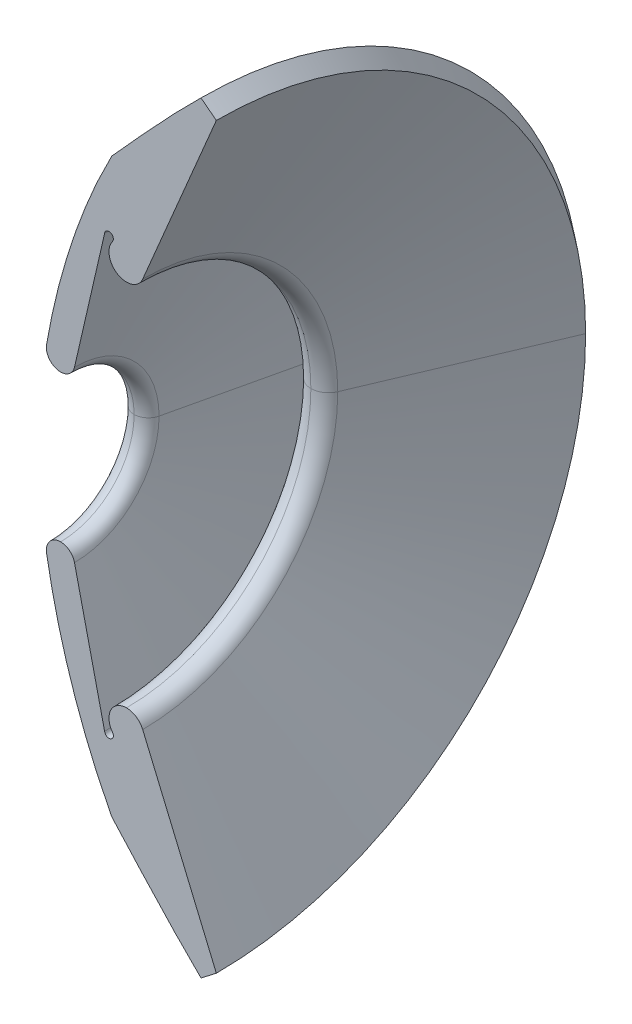
ISO-10303-21;
HEADER;
FILE_DESCRIPTION(('STEP AP214'),'2;1');
FILE_NAME('part.step','',(''),(''),'','','');
FILE_SCHEMA(('AUTOMOTIVE_DESIGN { 1 0 10303 214 1 1 1 1 }'));
ENDSEC;
DATA;
#1=APPLICATION_CONTEXT('core data for automotive mechanical design processes');
#2=APPLICATION_PROTOCOL_DEFINITION('international standard','automotive_design',2000,#1);
#3=PRODUCT_CONTEXT('',#1,'mechanical');
#4=PRODUCT('Part','Part','',(#3));
#5=PRODUCT_RELATED_PRODUCT_CATEGORY('part','',(#4));
#6=PRODUCT_DEFINITION_FORMATION('','',#4);
#7=PRODUCT_DEFINITION_CONTEXT('part definition',#1,'design');
#8=PRODUCT_DEFINITION('design','',#6,#7);
#9=PRODUCT_DEFINITION_SHAPE('','',#8);
#10=(LENGTH_UNIT() NAMED_UNIT(*) SI_UNIT(.MILLI.,.METRE.));
#11=(NAMED_UNIT(*) PLANE_ANGLE_UNIT() SI_UNIT($,.RADIAN.));
#12=(NAMED_UNIT(*) SI_UNIT($,.STERADIAN.) SOLID_ANGLE_UNIT());
#13=UNCERTAINTY_MEASURE_WITH_UNIT(LENGTH_MEASURE(1.E-05),#10,'distance_accuracy_value','');
#14=(GEOMETRIC_REPRESENTATION_CONTEXT(3) GLOBAL_UNCERTAINTY_ASSIGNED_CONTEXT((#13)) GLOBAL_UNIT_ASSIGNED_CONTEXT((#10,
#11,#12)) REPRESENTATION_CONTEXT('',''));
#15=CARTESIAN_POINT('',(0.,0.,0.));
#16=DIRECTION('',(0.,0.,1.));
#17=DIRECTION('',(1.,0.,0.));
#18=AXIS2_PLACEMENT_3D('',#15,#16,#17);
#19=CARTESIAN_POINT('',(0.,0.,0.));
#20=DIRECTION('',(0.,0.,1.));
#21=DIRECTION('',(1.,0.,0.));
#22=AXIS2_PLACEMENT_3D('',#19,#20,#21);
#23=PLANE('',#22);
#24=DIRECTION('',(-0.793279017623361,0.608858275954688,0.));
#25=VECTOR('',#24,1.);
#26=CARTESIAN_POINT('',(4.50781951059202,0.,0.));
#27=LINE('',#26,#25);
#28=CARTESIAN_POINT('',(-6.80370320936501,8.68183081701681,0.));
#29=VERTEX_POINT('',#28);
#30=CARTESIAN_POINT('',(-6.45373387807853,8.41322201866176,0.));
#31=VERTEX_POINT('',#30);
#32=EDGE_CURVE('E318',#29,#31,#27,.F.);
#33=ORIENTED_EDGE('',*,*,#32,.F.);
#34=CARTESIAN_POINT('',(-6.80370320936501,8.68183081701681,0.));
#35=CARTESIAN_POINT('',(-7.22405044240883,8.27392850217022,0.));
#36=CARTESIAN_POINT('',(-7.93930641714141,7.51090009317333,0.));
#37=CARTESIAN_POINT('',(-8.56158115236226,6.82596511589264,0.));
#38=CARTESIAN_POINT('',(-8.83528668489561,6.51959734050927,0.));
#39=(BOUNDED_CURVE() B_SPLINE_CURVE(3,(#34,#35,#36,#37,#38),.UNSPECIFIED.,.F.,
.F.) B_SPLINE_CURVE_WITH_KNOTS((4,1,4),(0.272608542358676,0.375,0.457699045748204),
.UNSPECIFIED.) CURVE() GEOMETRIC_REPRESENTATION_ITEM() RATIONAL_B_SPLINE_CURVE((1.,1.,1.,1.,1.)) REPRESENTATION_ITEM(''));
#40=CARTESIAN_POINT('',(-8.83528668489561,6.51959734050927,0.));
#41=VERTEX_POINT('',#40);
#42=EDGE_CURVE('E233',#29,#41,#39,.T.);
#43=ORIENTED_EDGE('',*,*,#42,.T.);
#44=DIRECTION('',(-0.439846475195651,-0.898072980474283,0.));
#45=VECTOR('',#44,1.);
#46=CARTESIAN_POINT('',(-12.0283700670541,0.,0.));
#47=LINE('',#46,#45);
#48=CARTESIAN_POINT('',(-9.17877169260346,5.81827398789354,0.));
#49=VERTEX_POINT('',#48);
#50=EDGE_CURVE('E323',#49,#41,#47,.F.);
#51=ORIENTED_EDGE('',*,*,#50,.F.);
#52=CARTESIAN_POINT('',(5.05300010291947,-0.560524208146894,0.));
#53=DIRECTION('',(0.,0.,1.));
#54=DIRECTION('',(1.,0.,0.));
#55=AXIS2_PLACEMENT_3D('',#52,#53,#54);
#56=CIRCLE('',#55,15.5959095555742);
#57=CARTESIAN_POINT('',(-10.3221203357982,2.05444545909126,0.));
#58=VERTEX_POINT('',#57);
#59=EDGE_CURVE('E61',#58,#49,#56,.F.);
#60=ORIENTED_EDGE('',*,*,#59,.F.);
#61=CARTESIAN_POINT('',(-10.00199980004,2.,0.));
#62=DIRECTION('',(0.,0.,1.));
#63=DIRECTION('',(1.,0.,0.));
#64=AXIS2_PLACEMENT_3D('',#61,#62,#63);
#65=CIRCLE('',#64,0.324717516358112);
#66=CARTESIAN_POINT('',(-10.00199980004,1.67528248364188,0.));
#67=VERTEX_POINT('',#66);
#68=EDGE_CURVE('E69',#67,#58,#65,.F.);
#69=ORIENTED_EDGE('',*,*,#68,.F.);
#70=CARTESIAN_POINT('',(-10.00199980004,2.,0.));
#71=DIRECTION('',(0.,0.,1.));
#72=DIRECTION('',(1.,0.,0.));
#73=AXIS2_PLACEMENT_3D('',#70,#71,#72);
#74=CIRCLE('',#73,0.324717516358112);
#75=CARTESIAN_POINT('',(-9.68553811514817,1.92724378084857,0.));
#76=VERTEX_POINT('',#75);
#77=EDGE_CURVE('E344',#76,#67,#74,.F.);
#78=ORIENTED_EDGE('',*,*,#77,.F.);
#79=DIRECTION('',(-0.224060038298619,-0.974575343027732,0.));
#80=VECTOR('',#79,1.);
#81=CARTESIAN_POINT('',(-10.1286216780938,0.,0.));
#82=LINE('',#81,#80);
#83=CARTESIAN_POINT('',(-8.99922025510829,4.91246358601071,0.));
#84=VERTEX_POINT('',#83);
#85=EDGE_CURVE('E349',#76,#84,#82,.F.);
#86=ORIENTED_EDGE('',*,*,#85,.T.);
#87=CARTESIAN_POINT('',(-8.9,4.9,0.));
#88=DIRECTION('',(0.,0.,1.));
#89=DIRECTION('',(1.,0.,0.));
#90=AXIS2_PLACEMENT_3D('',#87,#88,#89);
#91=CIRCLE('',#90,0.1);
#92=CARTESIAN_POINT('',(-8.82,4.84,0.));
#93=VERTEX_POINT('',#92);
#94=EDGE_CURVE('E346',#84,#93,#91,.F.);
#95=ORIENTED_EDGE('',*,*,#94,.T.);
#96=CARTESIAN_POINT('',(-8.5,4.6,0.));
#97=DIRECTION('',(0.,0.,1.));
#98=DIRECTION('',(1.,0.,0.));
#99=AXIS2_PLACEMENT_3D('',#96,#97,#98);
#100=CIRCLE('',#99,0.4);
#101=CARTESIAN_POINT('',(-8.5,4.2,0.));
#102=VERTEX_POINT('',#101);
#103=EDGE_CURVE('E339',#102,#93,#100,.F.);
#104=ORIENTED_EDGE('',*,*,#103,.F.);
#105=CARTESIAN_POINT('',(-8.5,4.6,0.));
#106=DIRECTION('',(0.,0.,1.));
#107=DIRECTION('',(1.,0.,0.));
#108=AXIS2_PLACEMENT_3D('',#105,#106,#107);
#109=CIRCLE('',#108,0.4);
#110=CARTESIAN_POINT('',(-8.13156827582901,4.44424999318014,0.));
#111=VERTEX_POINT('',#110);
#112=EDGE_CURVE('E337',#111,#102,#109,.F.);
#113=ORIENTED_EDGE('',*,*,#112,.F.);
#114=DIRECTION('',(-0.38937501704966,-0.921079310427488,0.));
#115=VECTOR('',#114,1.);
#116=CARTESIAN_POINT('',(-10.0103206235116,0.,0.));
#117=LINE('',#116,#115);
#118=EDGE_CURVE('E320',#111,#31,#117,.F.);
#119=ORIENTED_EDGE('',*,*,#118,.T.);
#120=EDGE_LOOP('',(#33,#43,#51,#60,#69,#78,#86,#95,#104,#113,#119));
#121=FACE_BOUND('',#120,.T.);
#122=ADVANCED_FACE('F46',(#121),#23,.T.);
#123=CARTESIAN_POINT('',(-10.00199980004,0.,0.));
#124=DIRECTION('',(1.,0.,0.));
#125=DIRECTION('',(0.,0.,-1.));
#126=AXIS2_PLACEMENT_3D('',#123,#124,#125);
#127=TOROIDAL_SURFACE('',#126,2.,0.324717516358112);
#128=CARTESIAN_POINT('',(-10.3221203357982,0.,0.));
#129=DIRECTION('',(1.,0.,0.));
#130=DIRECTION('',(0.,0.,-1.));
#131=AXIS2_PLACEMENT_3D('',#128,#129,#130);
#132=CIRCLE('',#131,2.05444545909116);
#133=CARTESIAN_POINT('',(-10.3221203357982,-2.05444545909126,0.));
#134=VERTEX_POINT('',#133);
#135=CARTESIAN_POINT('',(-10.3221203357982,0.,-2.05444545909116));
#136=VERTEX_POINT('',#135);
#137=EDGE_CURVE('E222',#134,#136,#132,.T.);
#138=ORIENTED_EDGE('',*,*,#137,.F.);
#139=CARTESIAN_POINT('',(-10.00199980004,-2.,0.));
#140=DIRECTION('',(0.,0.,1.));
#141=DIRECTION('',(1.,0.,0.));
#142=AXIS2_PLACEMENT_3D('',#139,#140,#141);
#143=CIRCLE('',#142,0.324717516358112);
#144=CARTESIAN_POINT('',(-10.00199980004,-1.67528248364189,0.));
#145=VERTEX_POINT('',#144);
#146=EDGE_CURVE('E368',#134,#145,#143,.F.);
#147=ORIENTED_EDGE('',*,*,#146,.T.);
#148=CARTESIAN_POINT('',(-10.00199980004,0.,0.));
#149=DIRECTION('',(1.,0.,0.));
#150=DIRECTION('',(0.,0.,-1.));
#151=AXIS2_PLACEMENT_3D('',#148,#149,#150);
#152=CIRCLE('',#151,1.67528248364188);
#153=CARTESIAN_POINT('',(-10.00199980004,0.,-1.67528248364188));
#154=VERTEX_POINT('',#153);
#155=EDGE_CURVE('E54',#145,#154,#152,.T.);
#156=ORIENTED_EDGE('',*,*,#155,.T.);
#157=CARTESIAN_POINT('',(-10.00199980004,0.,-2.));
#158=DIRECTION('',(0.,-1.,0.));
#159=DIRECTION('',(0.,0.,-1.));
#160=AXIS2_PLACEMENT_3D('',#157,#158,#159);
#161=CIRCLE('',#160,0.324717516358112);
#162=EDGE_CURVE('E244',#154,#136,#161,.T.);
#163=ORIENTED_EDGE('',*,*,#162,.T.);
#164=EDGE_LOOP('',(#138,#147,#156,#163));
#165=FACE_BOUND('',#164,.T.);
#166=ADVANCED_FACE('F375',(#165),#127,.T.);
#167=CARTESIAN_POINT('',(-8.5,0.,0.));
#168=DIRECTION('',(1.,0.,0.));
#169=DIRECTION('',(0.,0.,-1.));
#170=AXIS2_PLACEMENT_3D('',#167,#168,#169);
#171=TOROIDAL_SURFACE('',#170,4.6,0.4);
#172=CARTESIAN_POINT('',(-8.82,0.,0.));
#173=DIRECTION('',(1.,0.,0.));
#174=DIRECTION('',(0.,0.,-1.));
#175=AXIS2_PLACEMENT_3D('',#172,#173,#174);
#176=CIRCLE('',#175,4.84);
#177=CARTESIAN_POINT('',(-8.82,-4.84,0.));
#178=VERTEX_POINT('',#177);
#179=CARTESIAN_POINT('',(-8.82,0.,-4.84));
#180=VERTEX_POINT('',#179);
#181=EDGE_CURVE('E224',#178,#180,#176,.T.);
#182=ORIENTED_EDGE('',*,*,#181,.F.);
#183=CARTESIAN_POINT('',(-8.5,-4.6,0.));
#184=DIRECTION('',(0.,0.,1.));
#185=DIRECTION('',(1.,0.,0.));
#186=AXIS2_PLACEMENT_3D('',#183,#184,#185);
#187=CIRCLE('',#186,0.4);
#188=CARTESIAN_POINT('',(-8.5,-4.2,0.));
#189=VERTEX_POINT('',#188);
#190=EDGE_CURVE('E358',#178,#189,#187,.F.);
#191=ORIENTED_EDGE('',*,*,#190,.T.);
#192=CARTESIAN_POINT('',(-8.5,0.,0.));
#193=DIRECTION('',(1.,0.,0.));
#194=DIRECTION('',(0.,0.,-1.));
#195=AXIS2_PLACEMENT_3D('',#192,#193,#194);
#196=CIRCLE('',#195,4.2);
#197=CARTESIAN_POINT('',(-8.5,0.,-4.2));
#198=VERTEX_POINT('',#197);
#199=EDGE_CURVE('E208',#189,#198,#196,.T.);
#200=ORIENTED_EDGE('',*,*,#199,.T.);
#201=CARTESIAN_POINT('',(-8.5,0.,-4.6));
#202=DIRECTION('',(0.,-1.,0.));
#203=DIRECTION('',(0.,0.,-1.));
#204=AXIS2_PLACEMENT_3D('',#201,#202,#203);
#205=CIRCLE('',#204,0.4);
#206=EDGE_CURVE('E201',#198,#180,#205,.T.);
#207=ORIENTED_EDGE('',*,*,#206,.T.);
#208=EDGE_LOOP('',(#182,#191,#200,#207));
#209=FACE_BOUND('',#208,.T.);
#210=ADVANCED_FACE('F424',(#209),#171,.T.);
#211=CARTESIAN_POINT('',(-8.5,0.,0.));
#212=DIRECTION('',(1.,0.,0.));
#213=DIRECTION('',(0.,0.,-1.));
#214=AXIS2_PLACEMENT_3D('',#211,#212,#213);
#215=TOROIDAL_SURFACE('',#214,4.6,0.4);
#216=CARTESIAN_POINT('',(-8.5,0.,0.));
#217=DIRECTION('',(1.,0.,0.));
#218=DIRECTION('',(0.,0.,-1.));
#219=AXIS2_PLACEMENT_3D('',#216,#217,#218);
#220=CIRCLE('',#219,4.2);
#221=EDGE_CURVE('E239',#198,#102,#220,.T.);
#222=ORIENTED_EDGE('',*,*,#221,.T.);
#223=ORIENTED_EDGE('',*,*,#103,.T.);
#224=CARTESIAN_POINT('',(-8.82,0.,0.));
#225=DIRECTION('',(1.,0.,0.));
#226=DIRECTION('',(0.,0.,-1.));
#227=AXIS2_PLACEMENT_3D('',#224,#225,#226);
#228=CIRCLE('',#227,4.84);
#229=EDGE_CURVE('E303',#180,#93,#228,.T.);
#230=ORIENTED_EDGE('',*,*,#229,.F.);
#231=ORIENTED_EDGE('',*,*,#206,.F.);
#232=EDGE_LOOP('',(#222,#223,#230,#231));
#233=FACE_BOUND('',#232,.T.);
#234=ADVANCED_FACE('F407',(#233),#215,.T.);
#235=CARTESIAN_POINT('',(-10.00199980004,0.,0.));
#236=DIRECTION('',(1.,0.,0.));
#237=DIRECTION('',(0.,0.,-1.));
#238=AXIS2_PLACEMENT_3D('',#235,#236,#237);
#239=TOROIDAL_SURFACE('',#238,2.,0.324717516358112);
#240=CARTESIAN_POINT('',(-10.00199980004,0.,0.));
#241=DIRECTION('',(1.,0.,0.));
#242=DIRECTION('',(0.,0.,-1.));
#243=AXIS2_PLACEMENT_3D('',#240,#241,#242);
#244=CIRCLE('',#243,1.67528248364188);
#245=EDGE_CURVE('E236',#154,#67,#244,.T.);
#246=ORIENTED_EDGE('',*,*,#245,.T.);
#247=ORIENTED_EDGE('',*,*,#68,.T.);
#248=CARTESIAN_POINT('',(-10.3221203357982,0.,0.));
#249=DIRECTION('',(1.,0.,0.));
#250=DIRECTION('',(0.,0.,-1.));
#251=AXIS2_PLACEMENT_3D('',#248,#249,#250);
#252=CIRCLE('',#251,2.05444545909116);
#253=EDGE_CURVE('E310',#136,#58,#252,.T.);
#254=ORIENTED_EDGE('',*,*,#253,.F.);
#255=ORIENTED_EDGE('',*,*,#162,.F.);
#256=EDGE_LOOP('',(#246,#247,#254,#255));
#257=FACE_BOUND('',#256,.T.);
#258=ADVANCED_FACE('F378',(#257),#239,.T.);
#259=CARTESIAN_POINT('',(-8.83528668489561,0.,0.));
#260=DIRECTION('',(1.,0.,0.));
#261=DIRECTION('',(0.,0.,-1.));
#262=AXIS2_PLACEMENT_3D('',#259,#260,#261);
#263=CONICAL_SURFACE('',#262,6.51959734050927,1.11536860969764);
#264=CARTESIAN_POINT('',(-9.17877169260346,0.,0.));
#265=DIRECTION('',(1.,0.,0.));
#266=DIRECTION('',(0.,0.,-1.));
#267=AXIS2_PLACEMENT_3D('',#264,#265,#266);
#268=CIRCLE('',#267,5.81827398789355);
#269=CARTESIAN_POINT('',(-9.17877169260346,0.,-5.81827398789355));
#270=VERTEX_POINT('',#269);
#271=EDGE_CURVE('E240',#270,#49,#268,.T.);
#272=ORIENTED_EDGE('',*,*,#271,.T.);
#273=ORIENTED_EDGE('',*,*,#50,.T.);
#274=CARTESIAN_POINT('',(-8.83528668489561,0.,0.));
#275=DIRECTION('',(1.,0.,0.));
#276=DIRECTION('',(0.,0.,-1.));
#277=AXIS2_PLACEMENT_3D('',#274,#275,#276);
#278=CIRCLE('',#277,6.51959734050927);
#279=CARTESIAN_POINT('',(-8.83528668489561,0.,-6.51959734050927));
#280=VERTEX_POINT('',#279);
#281=EDGE_CURVE('E194',#280,#41,#278,.T.);
#282=ORIENTED_EDGE('',*,*,#281,.F.);
#283=DIRECTION('',(0.439846475195651,0.,-0.898072980474283));
#284=VECTOR('',#283,1.);
#285=CARTESIAN_POINT('',(-8.83528668489561,0.,-6.51959734050927));
#286=LINE('',#285,#284);
#287=EDGE_CURVE('E190',#270,#280,#286,.T.);
#288=ORIENTED_EDGE('',*,*,#287,.F.);
#289=EDGE_LOOP('',(#272,#273,#282,#288));
#290=FACE_BOUND('',#289,.T.);
#291=ADVANCED_FACE('F460',(#290),#263,.T.);
#292=CARTESIAN_POINT('',(5.05300010291947,0.,0.));
#293=DIRECTION('',(1.,0.,0.));
#294=DIRECTION('',(0.,0.,1.));
#295=AXIS2_PLACEMENT_3D('',#292,#293,#294);
#296=DEGENERATE_TOROIDAL_SURFACE('',#295,0.560524208146894,15.5959095555742,.F.);
#297=ORIENTED_EDGE('',*,*,#253,.T.);
#298=ORIENTED_EDGE('',*,*,#59,.T.);
#299=ORIENTED_EDGE('',*,*,#271,.F.);
#300=CARTESIAN_POINT('',(5.05300010291947,0.,0.560524208146894));
#301=DIRECTION('',(0.,-1.,0.));
#302=DIRECTION('',(0.,0.,-1.));
#303=AXIS2_PLACEMENT_3D('',#300,#301,#302);
#304=CIRCLE('',#303,15.5959095555742);
#305=EDGE_CURVE('E216',#136,#270,#304,.T.);
#306=ORIENTED_EDGE('',*,*,#305,.F.);
#307=EDGE_LOOP('',(#297,#298,#299,#306));
#308=FACE_BOUND('',#307,.T.);
#309=ADVANCED_FACE('F332',(#308),#296,.F.);
#310=CARTESIAN_POINT('',(-10.00199980004,0.,0.));
#311=DIRECTION('',(1.,0.,0.));
#312=DIRECTION('',(0.,0.,-1.));
#313=AXIS2_PLACEMENT_3D('',#310,#311,#312);
#314=TOROIDAL_SURFACE('',#313,2.,0.324717516358112);
#315=CARTESIAN_POINT('',(-9.68553811514817,0.,0.));
#316=DIRECTION('',(1.,0.,0.));
#317=DIRECTION('',(0.,0.,-1.));
#318=AXIS2_PLACEMENT_3D('',#315,#316,#317);
#319=CIRCLE('',#318,1.92724378084857);
#320=CARTESIAN_POINT('',(-9.68553811514817,0.,-1.92724378084857));
#321=VERTEX_POINT('',#320);
#322=EDGE_CURVE('E242',#321,#76,#319,.T.);
#323=ORIENTED_EDGE('',*,*,#322,.T.);
#324=ORIENTED_EDGE('',*,*,#77,.T.);
#325=ORIENTED_EDGE('',*,*,#245,.F.);
#326=CARTESIAN_POINT('',(-10.00199980004,0.,-2.));
#327=DIRECTION('',(0.,-1.,0.));
#328=DIRECTION('',(0.,0.,-1.));
#329=AXIS2_PLACEMENT_3D('',#326,#327,#328);
#330=CIRCLE('',#329,0.324717516358112);
#331=EDGE_CURVE('E235',#321,#154,#330,.T.);
#332=ORIENTED_EDGE('',*,*,#331,.F.);
#333=EDGE_LOOP('',(#323,#324,#325,#332));
#334=FACE_BOUND('',#333,.T.);
#335=ADVANCED_FACE('F385',(#334),#314,.T.);
#336=CARTESIAN_POINT('',(-9.68553811514817,0.,0.));
#337=DIRECTION('',(1.,0.,0.));
#338=DIRECTION('',(0.,0.,-1.));
#339=AXIS2_PLACEMENT_3D('',#336,#337,#338);
#340=CONICAL_SURFACE('',#339,1.92724378084857,1.34481788108186);
#341=DIRECTION('',(0.224060038298619,-0.974575343027732,0.));
#342=VECTOR('',#341,1.);
#343=CARTESIAN_POINT('',(-10.1286216780938,0.,0.));
#344=LINE('',#343,#342);
#345=CARTESIAN_POINT('',(-8.99922025510829,-4.91246358601071,0.));
#346=VERTEX_POINT('',#345);
#347=CARTESIAN_POINT('',(-9.68553811514817,-1.92724378084859,0.));
#348=VERTEX_POINT('',#347);
#349=EDGE_CURVE('E363',#346,#348,#344,.F.);
#350=ORIENTED_EDGE('',*,*,#349,.F.);
#351=CARTESIAN_POINT('',(-8.99922025510829,0.,0.));
#352=DIRECTION('',(1.,0.,0.));
#353=DIRECTION('',(0.,0.,-1.));
#354=AXIS2_PLACEMENT_3D('',#351,#352,#353);
#355=CIRCLE('',#354,4.91246358601071);
#356=CARTESIAN_POINT('',(-8.99922025510829,0.,-4.91246358601071));
#357=VERTEX_POINT('',#356);
#358=EDGE_CURVE('E225',#346,#357,#355,.T.);
#359=ORIENTED_EDGE('',*,*,#358,.T.);
#360=DIRECTION('',(0.224060038298619,0.,-0.974575343027732));
#361=VECTOR('',#360,1.);
#362=CARTESIAN_POINT('',(-9.68553811514817,0.,-1.92724378084857));
#363=LINE('',#362,#361);
#364=EDGE_CURVE('E307',#321,#357,#363,.T.);
#365=ORIENTED_EDGE('',*,*,#364,.F.);
#366=CARTESIAN_POINT('',(-9.68553811514817,0.,0.));
#367=DIRECTION('',(1.,0.,0.));
#368=DIRECTION('',(0.,0.,-1.));
#369=AXIS2_PLACEMENT_3D('',#366,#367,#368);
#370=CIRCLE('',#369,1.92724378084857);
#371=EDGE_CURVE('E290',#348,#321,#370,.T.);
#372=ORIENTED_EDGE('',*,*,#371,.F.);
#373=EDGE_LOOP('',(#350,#359,#365,#372));
#374=FACE_BOUND('',#373,.T.);
#375=ADVANCED_FACE('F392',(#374),#340,.F.);
#376=CARTESIAN_POINT('',(-8.9,0.,0.));
#377=DIRECTION('',(1.,0.,0.));
#378=DIRECTION('',(0.,0.,-1.));
#379=AXIS2_PLACEMENT_3D('',#376,#377,#378);
#380=TOROIDAL_SURFACE('',#379,4.9,0.1);
#381=CARTESIAN_POINT('',(-8.9,-4.9,0.));
#382=DIRECTION('',(0.,0.,1.));
#383=DIRECTION('',(1.,0.,0.));
#384=AXIS2_PLACEMENT_3D('',#381,#382,#383);
#385=CIRCLE('',#384,0.1);
#386=EDGE_CURVE('E361',#178,#346,#385,.F.);
#387=ORIENTED_EDGE('',*,*,#386,.F.);
#388=ORIENTED_EDGE('',*,*,#181,.T.);
#389=CARTESIAN_POINT('',(-8.9,0.,-4.9));
#390=DIRECTION('',(0.,-1.,0.));
#391=DIRECTION('',(0.,0.,-1.));
#392=AXIS2_PLACEMENT_3D('',#389,#390,#391);
#393=CIRCLE('',#392,0.1);
#394=EDGE_CURVE('E214',#357,#180,#393,.T.);
#395=ORIENTED_EDGE('',*,*,#394,.F.);
#396=ORIENTED_EDGE('',*,*,#358,.F.);
#397=EDGE_LOOP('',(#387,#388,#395,#396));
#398=FACE_BOUND('',#397,.T.);
#399=ADVANCED_FACE('F396',(#398),#380,.F.);
#400=CARTESIAN_POINT('',(-8.5,0.,0.));
#401=DIRECTION('',(1.,0.,0.));
#402=DIRECTION('',(0.,0.,-1.));
#403=AXIS2_PLACEMENT_3D('',#400,#401,#402);
#404=TOROIDAL_SURFACE('',#403,4.6,0.4);
#405=CARTESIAN_POINT('',(-8.13156827582901,0.,0.));
#406=DIRECTION('',(1.,0.,0.));
#407=DIRECTION('',(0.,0.,-1.));
#408=AXIS2_PLACEMENT_3D('',#405,#406,#407);
#409=CIRCLE('',#408,4.44424999318014);
#410=CARTESIAN_POINT('',(-8.13156827582901,0.,-4.44424999318014));
#411=VERTEX_POINT('',#410);
#412=EDGE_CURVE('E226',#411,#111,#409,.T.);
#413=ORIENTED_EDGE('',*,*,#412,.T.);
#414=ORIENTED_EDGE('',*,*,#112,.T.);
#415=ORIENTED_EDGE('',*,*,#221,.F.);
#416=CARTESIAN_POINT('',(-8.5,0.,-4.6));
#417=DIRECTION('',(0.,-1.,0.));
#418=DIRECTION('',(0.,0.,-1.));
#419=AXIS2_PLACEMENT_3D('',#416,#417,#418);
#420=CIRCLE('',#419,0.4);
#421=EDGE_CURVE('E248',#411,#198,#420,.T.);
#422=ORIENTED_EDGE('',*,*,#421,.F.);
#423=EDGE_LOOP('',(#413,#414,#415,#422));
#424=FACE_BOUND('',#423,.T.);
#425=ADVANCED_FACE('F412',(#424),#404,.T.);
#426=CARTESIAN_POINT('',(-8.13156827582901,0.,0.));
#427=DIRECTION('',(1.,0.,0.));
#428=DIRECTION('',(0.,0.,-1.));
#429=AXIS2_PLACEMENT_3D('',#426,#427,#428);
#430=CONICAL_SURFACE('',#429,4.44424999318014,1.17084336475273);
#431=DIRECTION('',(0.38937501704966,-0.921079310427488,0.));
#432=VECTOR('',#431,1.);
#433=CARTESIAN_POINT('',(-10.0103206235116,0.,0.));
#434=LINE('',#433,#432);
#435=CARTESIAN_POINT('',(-6.45373387807854,-8.41322201866174,0.));
#436=VERTEX_POINT('',#435);
#437=CARTESIAN_POINT('',(-8.13156827582901,-4.44424999318013,0.));
#438=VERTEX_POINT('',#437);
#439=EDGE_CURVE('E353',#436,#438,#434,.F.);
#440=ORIENTED_EDGE('',*,*,#439,.F.);
#441=CARTESIAN_POINT('',(-6.45373387807853,0.,0.));
#442=DIRECTION('',(1.,0.,0.));
#443=DIRECTION('',(0.,0.,-1.));
#444=AXIS2_PLACEMENT_3D('',#441,#442,#443);
#445=CIRCLE('',#444,8.41322201866174);
#446=CARTESIAN_POINT('',(-6.45373387807853,0.,-8.41322201866174));
#447=VERTEX_POINT('',#446);
#448=EDGE_CURVE('E249',#436,#447,#445,.T.);
#449=ORIENTED_EDGE('',*,*,#448,.T.);
#450=DIRECTION('',(0.38937501704966,0.,-0.921079310427488));
#451=VECTOR('',#450,1.);
#452=CARTESIAN_POINT('',(-8.13156827582901,0.,-4.44424999318014));
#453=LINE('',#452,#451);
#454=EDGE_CURVE('E257',#411,#447,#453,.T.);
#455=ORIENTED_EDGE('',*,*,#454,.F.);
#456=CARTESIAN_POINT('',(-8.13156827582901,0.,0.));
#457=DIRECTION('',(1.,0.,0.));
#458=DIRECTION('',(0.,0.,-1.));
#459=AXIS2_PLACEMENT_3D('',#456,#457,#458);
#460=CIRCLE('',#459,4.44424999318014);
#461=EDGE_CURVE('E245',#438,#411,#460,.T.);
#462=ORIENTED_EDGE('',*,*,#461,.F.);
#463=EDGE_LOOP('',(#440,#449,#455,#462));
#464=FACE_BOUND('',#463,.T.);
#465=ADVANCED_FACE('F48',(#464),#430,.F.);
#466=CARTESIAN_POINT('',(-6.45373387807853,0.,0.));
#467=DIRECTION('',(-1.,0.,0.));
#468=DIRECTION('',(0.,0.,1.));
#469=AXIS2_PLACEMENT_3D('',#466,#467,#468);
#470=CONICAL_SURFACE('',#469,8.41322201866174,0.65462054811976);
#471=CARTESIAN_POINT('',(-6.80370320936501,0.,0.));
#472=DIRECTION('',(1.,0.,0.));
#473=DIRECTION('',(0.,0.,-1.));
#474=AXIS2_PLACEMENT_3D('',#471,#472,#473);
#475=CIRCLE('',#474,8.68183081701681);
#476=CARTESIAN_POINT('',(-6.80370320936501,0.,-8.68183081701681));
#477=VERTEX_POINT('',#476);
#478=EDGE_CURVE('E228',#477,#29,#475,.T.);
#479=ORIENTED_EDGE('',*,*,#478,.T.);
#480=ORIENTED_EDGE('',*,*,#32,.T.);
#481=CARTESIAN_POINT('',(-6.45373387807853,0.,0.));
#482=DIRECTION('',(1.,0.,0.));
#483=DIRECTION('',(0.,0.,-1.));
#484=AXIS2_PLACEMENT_3D('',#481,#482,#483);
#485=CIRCLE('',#484,8.41322201866174);
#486=EDGE_CURVE('E247',#447,#31,#485,.T.);
#487=ORIENTED_EDGE('',*,*,#486,.F.);
#488=DIRECTION('',(-0.793279017623361,0.,-0.608858275954688));
#489=VECTOR('',#488,1.);
#490=CARTESIAN_POINT('',(-6.45373387807853,0.,-8.41322201866174));
#491=LINE('',#490,#489);
#492=EDGE_CURVE('E232',#447,#477,#491,.T.);
#493=ORIENTED_EDGE('',*,*,#492,.T.);
#494=EDGE_LOOP('',(#479,#480,#487,#493));
#495=FACE_BOUND('',#494,.T.);
#496=ADVANCED_FACE('F283',(#495),#470,.T.);
#497=CARTESIAN_POINT('',(-6.45373387807853,0.,0.));
#498=DIRECTION('',(-1.,0.,0.));
#499=DIRECTION('',(0.,0.,1.));
#500=AXIS2_PLACEMENT_3D('',#497,#498,#499);
#501=CONICAL_SURFACE('',#500,8.41322201866174,0.65462054811976);
#502=ORIENTED_EDGE('',*,*,#448,.F.);
#503=DIRECTION('',(0.793279017623361,0.608858275954688,0.));
#504=VECTOR('',#503,1.);
#505=CARTESIAN_POINT('',(4.50781951059202,0.,0.));
#506=LINE('',#505,#504);
#507=CARTESIAN_POINT('',(-6.80370320936501,-8.68183081701681,0.));
#508=VERTEX_POINT('',#507);
#509=EDGE_CURVE('E279',#436,#508,#506,.F.);
#510=ORIENTED_EDGE('',*,*,#509,.T.);
#511=CARTESIAN_POINT('',(-6.80370320936501,0.,0.));
#512=DIRECTION('',(1.,0.,0.));
#513=DIRECTION('',(0.,0.,-1.));
#514=AXIS2_PLACEMENT_3D('',#511,#512,#513);
#515=CIRCLE('',#514,8.68183081701681);
#516=EDGE_CURVE('E199',#508,#477,#515,.T.);
#517=ORIENTED_EDGE('',*,*,#516,.T.);
#518=ORIENTED_EDGE('',*,*,#492,.F.);
#519=EDGE_LOOP('',(#502,#510,#517,#518));
#520=FACE_BOUND('',#519,.T.);
#521=ADVANCED_FACE('F277',(#520),#501,.T.);
#522=CARTESIAN_POINT('',(-8.13156827582901,0.,0.));
#523=DIRECTION('',(1.,0.,0.));
#524=DIRECTION('',(0.,0.,-1.));
#525=AXIS2_PLACEMENT_3D('',#522,#523,#524);
#526=CONICAL_SURFACE('',#525,4.44424999318014,1.17084336475273);
#527=ORIENTED_EDGE('',*,*,#118,.F.);
#528=ORIENTED_EDGE('',*,*,#412,.F.);
#529=ORIENTED_EDGE('',*,*,#454,.T.);
#530=ORIENTED_EDGE('',*,*,#486,.T.);
#531=EDGE_LOOP('',(#527,#528,#529,#530));
#532=FACE_BOUND('',#531,.T.);
#533=ADVANCED_FACE('F416',(#532),#526,.F.);
#534=CARTESIAN_POINT('',(-8.5,0.,0.));
#535=DIRECTION('',(1.,0.,0.));
#536=DIRECTION('',(0.,0.,-1.));
#537=AXIS2_PLACEMENT_3D('',#534,#535,#536);
#538=TOROIDAL_SURFACE('',#537,4.6,0.4);
#539=ORIENTED_EDGE('',*,*,#199,.F.);
#540=CARTESIAN_POINT('',(-8.5,-4.6,0.));
#541=DIRECTION('',(0.,0.,1.));
#542=DIRECTION('',(1.,0.,0.));
#543=AXIS2_PLACEMENT_3D('',#540,#541,#542);
#544=CIRCLE('',#543,0.4);
#545=EDGE_CURVE('E355',#189,#438,#544,.F.);
#546=ORIENTED_EDGE('',*,*,#545,.T.);
#547=ORIENTED_EDGE('',*,*,#461,.T.);
#548=ORIENTED_EDGE('',*,*,#421,.T.);
#549=EDGE_LOOP('',(#539,#546,#547,#548));
#550=FACE_BOUND('',#549,.T.);
#551=ADVANCED_FACE('F422',(#550),#538,.T.);
#552=CARTESIAN_POINT('',(-8.9,0.,0.));
#553=DIRECTION('',(1.,0.,0.));
#554=DIRECTION('',(0.,0.,-1.));
#555=AXIS2_PLACEMENT_3D('',#552,#553,#554);
#556=TOROIDAL_SURFACE('',#555,4.9,0.1);
#557=ORIENTED_EDGE('',*,*,#94,.F.);
#558=CARTESIAN_POINT('',(-8.99922025510829,0.,0.));
#559=DIRECTION('',(1.,0.,0.));
#560=DIRECTION('',(0.,0.,-1.));
#561=AXIS2_PLACEMENT_3D('',#558,#559,#560);
#562=CIRCLE('',#561,4.91246358601071);
#563=EDGE_CURVE('E316',#357,#84,#562,.T.);
#564=ORIENTED_EDGE('',*,*,#563,.F.);
#565=ORIENTED_EDGE('',*,*,#394,.T.);
#566=ORIENTED_EDGE('',*,*,#229,.T.);
#567=EDGE_LOOP('',(#557,#564,#565,#566));
#568=FACE_BOUND('',#567,.T.);
#569=ADVANCED_FACE('F403',(#568),#556,.F.);
#570=CARTESIAN_POINT('',(-9.68553811514817,0.,0.));
#571=DIRECTION('',(1.,0.,0.));
#572=DIRECTION('',(0.,0.,-1.));
#573=AXIS2_PLACEMENT_3D('',#570,#571,#572);
#574=CONICAL_SURFACE('',#573,1.92724378084857,1.34481788108186);
#575=ORIENTED_EDGE('',*,*,#85,.F.);
#576=ORIENTED_EDGE('',*,*,#322,.F.);
#577=ORIENTED_EDGE('',*,*,#364,.T.);
#578=ORIENTED_EDGE('',*,*,#563,.T.);
#579=EDGE_LOOP('',(#575,#576,#577,#578));
#580=FACE_BOUND('',#579,.T.);
#581=ADVANCED_FACE('F388',(#580),#574,.F.);
#582=CARTESIAN_POINT('',(-10.00199980004,0.,0.));
#583=DIRECTION('',(1.,0.,0.));
#584=DIRECTION('',(0.,0.,-1.));
#585=AXIS2_PLACEMENT_3D('',#582,#583,#584);
#586=TOROIDAL_SURFACE('',#585,2.,0.324717516358112);
#587=ORIENTED_EDGE('',*,*,#155,.F.);
#588=CARTESIAN_POINT('',(-10.00199980004,-2.,0.));
#589=DIRECTION('',(0.,0.,1.));
#590=DIRECTION('',(1.,0.,0.));
#591=AXIS2_PLACEMENT_3D('',#588,#589,#590);
#592=CIRCLE('',#591,0.324717516358112);
#593=EDGE_CURVE('E365',#145,#348,#592,.F.);
#594=ORIENTED_EDGE('',*,*,#593,.T.);
#595=ORIENTED_EDGE('',*,*,#371,.T.);
#596=ORIENTED_EDGE('',*,*,#331,.T.);
#597=EDGE_LOOP('',(#587,#594,#595,#596));
#598=FACE_BOUND('',#597,.T.);
#599=ADVANCED_FACE('F381',(#598),#586,.T.);
#600=CARTESIAN_POINT('',(5.05300010291947,0.,0.));
#601=DIRECTION('',(1.,0.,0.));
#602=DIRECTION('',(0.,0.,1.));
#603=AXIS2_PLACEMENT_3D('',#600,#601,#602);
#604=DEGENERATE_TOROIDAL_SURFACE('',#603,0.560524208146894,15.5959095555742,.F.);
#605=CARTESIAN_POINT('',(-9.17877169260346,0.,0.));
#606=DIRECTION('',(1.,0.,0.));
#607=DIRECTION('',(0.,0.,-1.));
#608=AXIS2_PLACEMENT_3D('',#605,#606,#607);
#609=CIRCLE('',#608,5.81827398789355);
#610=CARTESIAN_POINT('',(-9.17877169260346,-5.81827398789355,0.));
#611=VERTEX_POINT('',#610);
#612=EDGE_CURVE('E223',#611,#270,#609,.T.);
#613=ORIENTED_EDGE('',*,*,#612,.F.);
#614=CARTESIAN_POINT('',(5.05300010291947,0.560524208146894,0.));
#615=DIRECTION('',(0.,0.,1.));
#616=DIRECTION('',(1.,0.,0.));
#617=AXIS2_PLACEMENT_3D('',#614,#615,#616);
#618=CIRCLE('',#617,15.5959095555742);
#619=EDGE_CURVE('E182',#611,#134,#618,.F.);
#620=ORIENTED_EDGE('',*,*,#619,.T.);
#621=ORIENTED_EDGE('',*,*,#137,.T.);
#622=ORIENTED_EDGE('',*,*,#305,.T.);
#623=EDGE_LOOP('',(#613,#620,#621,#622));
#624=FACE_BOUND('',#623,.T.);
#625=ADVANCED_FACE('F373',(#624),#604,.F.);
#626=CARTESIAN_POINT('',(-8.83528668489561,0.,0.));
#627=DIRECTION('',(1.,0.,0.));
#628=DIRECTION('',(0.,0.,-1.));
#629=AXIS2_PLACEMENT_3D('',#626,#627,#628);
#630=CONICAL_SURFACE('',#629,6.51959734050927,1.11536860969764);
#631=CARTESIAN_POINT('',(-8.83528668489561,0.,0.));
#632=DIRECTION('',(1.,0.,0.));
#633=DIRECTION('',(0.,0.,-1.));
#634=AXIS2_PLACEMENT_3D('',#631,#632,#633);
#635=CIRCLE('',#634,6.51959734050927);
#636=CARTESIAN_POINT('',(-8.83528668489561,-6.51959734050927,0.));
#637=VERTEX_POINT('',#636);
#638=EDGE_CURVE('E187',#637,#280,#635,.T.);
#639=ORIENTED_EDGE('',*,*,#638,.F.);
#640=DIRECTION('',(0.439846475195651,-0.898072980474283,0.));
#641=VECTOR('',#640,1.);
#642=CARTESIAN_POINT('',(-12.0283700670541,0.,0.));
#643=LINE('',#642,#641);
#644=EDGE_CURVE('E11',#637,#611,#643,.F.);
#645=ORIENTED_EDGE('',*,*,#644,.T.);
#646=ORIENTED_EDGE('',*,*,#612,.T.);
#647=ORIENTED_EDGE('',*,*,#287,.T.);
#648=EDGE_LOOP('',(#639,#645,#646,#647));
#649=FACE_BOUND('',#648,.T.);
#650=ADVANCED_FACE('F188',(#649),#630,.T.);
#651=CARTESIAN_POINT('',(-6.80370320936501,-8.68183081701681,0.));
#652=CARTESIAN_POINT('',(-6.803703209365,-8.6818308170168,-17.3636616340336));
#653=CARTESIAN_POINT('',(-6.803703209365,8.6818308170168,-17.3636616340336));
#654=CARTESIAN_POINT('',(-6.80370320936501,8.68183081701681,0.));
#655=CARTESIAN_POINT('',(-7.22405044240883,-8.27392850217022,0.));
#656=CARTESIAN_POINT('',(-7.22405044240883,-8.27392850217022,-16.5478570043404));
#657=CARTESIAN_POINT('',(-7.22405044240883,8.27392850217022,-16.5478570043404));
#658=CARTESIAN_POINT('',(-7.22405044240883,8.27392850217022,0.));
#659=CARTESIAN_POINT('',(-7.93930641714141,-7.51090009317333,0.));
#660=CARTESIAN_POINT('',(-7.93930641714141,-7.51090009317333,-15.0218001863467));
#661=CARTESIAN_POINT('',(-7.93930641714141,7.51090009317333,-15.0218001863467));
#662=CARTESIAN_POINT('',(-7.93930641714141,7.51090009317333,0.));
#663=CARTESIAN_POINT('',(-8.56158115236226,-6.82596511589263,0.));
#664=CARTESIAN_POINT('',(-8.56158115236226,-6.82596511589263,-13.6519302317853));
#665=CARTESIAN_POINT('',(-8.56158115236226,6.82596511589263,-13.6519302317853));
#666=CARTESIAN_POINT('',(-8.56158115236226,6.82596511589263,0.));
#667=CARTESIAN_POINT('',(-8.83528668489561,-6.51959734050927,0.));
#668=CARTESIAN_POINT('',(-8.83528668489561,-6.51959734050927,-13.0391946810185));
#669=CARTESIAN_POINT('',(-8.83528668489561,6.51959734050927,-13.0391946810185));
#670=CARTESIAN_POINT('',(-8.83528668489561,6.51959734050927,0.));
#671=(BOUNDED_SURFACE() B_SPLINE_SURFACE(3,3,((#651,#652,#653,#654),(#655,#656,#657,#658),(#659,
#660,#661,#662),(#663,#664,#665,#666),(#667,#668,#669,#670)),.UNSPECIFIED.,.F.,.F.,
.F.) B_SPLINE_SURFACE_WITH_KNOTS((4,1,4),(4,4),(0.272608542358676,0.375,0.457699045748204),(0.,
1.),.UNSPECIFIED.) GEOMETRIC_REPRESENTATION_ITEM() RATIONAL_B_SPLINE_SURFACE(((1.,
0.333333333333334,0.333333333333334,1.),(1.,0.333333333333334,0.333333333333334,1.),(1.,
0.333333333333334,0.333333333333334,1.),(1.,0.333333333333334,0.333333333333334,1.),(1.,
0.333333333333334,0.333333333333334,1.))) REPRESENTATION_ITEM('') SURFACE());
#672=CARTESIAN_POINT('',(-6.80370320936501,-8.68183081701681,0.));
#673=CARTESIAN_POINT('',(-7.22405044240883,-8.27392850217022,0.));
#674=CARTESIAN_POINT('',(-7.93930641714141,-7.51090009317333,0.));
#675=CARTESIAN_POINT('',(-8.56158115236226,-6.82596511589264,0.));
#676=CARTESIAN_POINT('',(-8.83528668489561,-6.51959734050927,0.));
#677=(BOUNDED_CURVE() B_SPLINE_CURVE(3,(#672,#673,#674,#675,#676),.UNSPECIFIED.,.F.,
.F.) B_SPLINE_CURVE_WITH_KNOTS((4,1,4),(0.272608542358676,0.375,0.457699045748204),
.UNSPECIFIED.) CURVE() GEOMETRIC_REPRESENTATION_ITEM() RATIONAL_B_SPLINE_CURVE((1.,1.,1.,1.,1.)) REPRESENTATION_ITEM(''));
#678=EDGE_CURVE('E179',#508,#637,#677,.T.);
#679=ORIENTED_EDGE('',*,*,#516,.F.);
#680=ORIENTED_EDGE('',*,*,#678,.T.);
#681=ORIENTED_EDGE('',*,*,#638,.T.);
#682=ORIENTED_EDGE('',*,*,#281,.T.);
#683=ORIENTED_EDGE('',*,*,#42,.F.);
#684=ORIENTED_EDGE('',*,*,#478,.F.);
#685=EDGE_LOOP('',(#679,#680,#681,#682,#683,#684));
#686=FACE_BOUND('',#685,.T.);
#687=ADVANCED_FACE('F197',(#686),#671,.T.);
#688=ORIENTED_EDGE('',*,*,#509,.F.);
#689=ORIENTED_EDGE('',*,*,#439,.T.);
#690=ORIENTED_EDGE('',*,*,#545,.F.);
#691=ORIENTED_EDGE('',*,*,#190,.F.);
#692=ORIENTED_EDGE('',*,*,#386,.T.);
#693=ORIENTED_EDGE('',*,*,#349,.T.);
#694=ORIENTED_EDGE('',*,*,#593,.F.);
#695=ORIENTED_EDGE('',*,*,#146,.F.);
#696=ORIENTED_EDGE('',*,*,#619,.F.);
#697=ORIENTED_EDGE('',*,*,#644,.F.);
#698=ORIENTED_EDGE('',*,*,#678,.F.);
#699=EDGE_LOOP('',(#688,#689,#690,#691,#692,#693,#694,#695,#696,#697,#698));
#700=FACE_BOUND('',#699,.T.);
#701=ADVANCED_FACE('F177',(#700),#23,.T.);
#702=CLOSED_SHELL('',(#122,#166,#210,#234,#258,#291,#309,#335,#375,#399,#425,#465,#496,#521,
#533,#551,#569,#581,#599,#625,#650,#687,#701));
#703=MANIFOLD_SOLID_BREP('B2',#702);
#704=ADVANCED_BREP_SHAPE_REPRESENTATION('',(#18,#703),#14);
#705=SHAPE_DEFINITION_REPRESENTATION(#9,#704);
ENDSEC;
END-ISO-10303-21;
